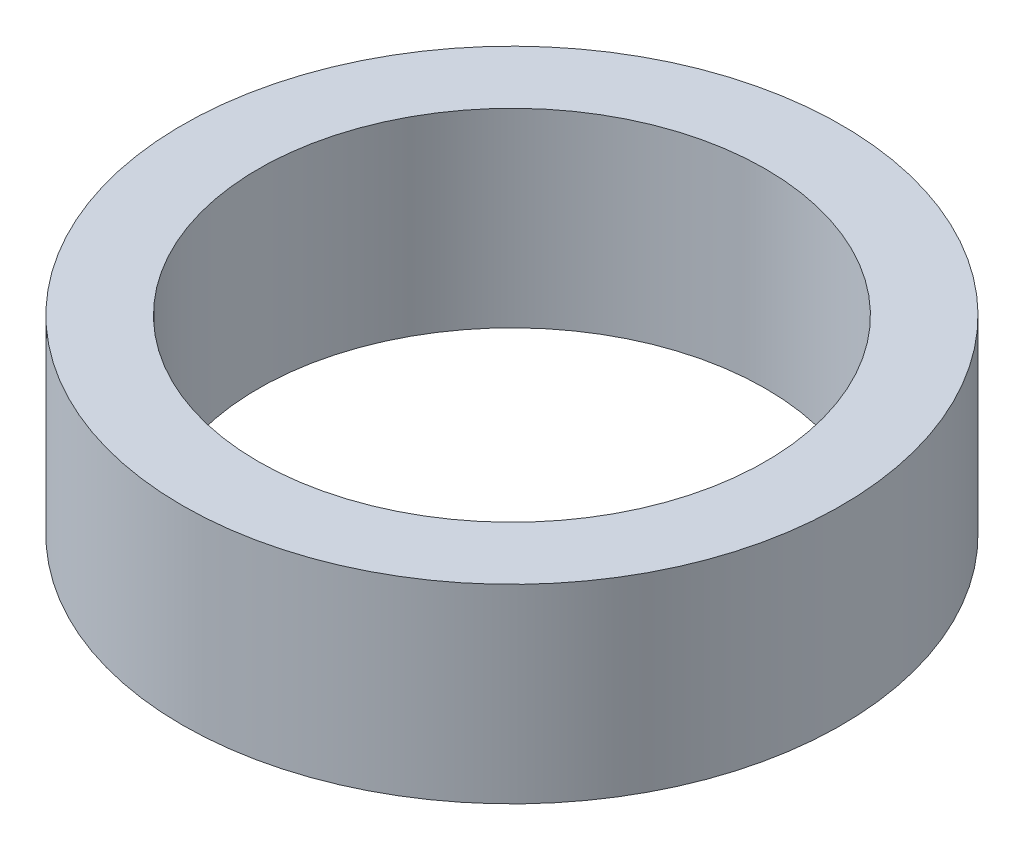
ISO-10303-21;
HEADER;
FILE_DESCRIPTION(('STEP AP214'),'2;1');
FILE_NAME('part.step','',(''),(''),'','','');
FILE_SCHEMA(('AUTOMOTIVE_DESIGN { 1 0 10303 214 1 1 1 1 }'));
ENDSEC;
DATA;
#1=APPLICATION_CONTEXT('core data for automotive mechanical design processes');
#2=APPLICATION_PROTOCOL_DEFINITION('international standard','automotive_design',2000,#1);
#3=PRODUCT_CONTEXT('',#1,'mechanical');
#4=PRODUCT('Part','Part','',(#3));
#5=PRODUCT_RELATED_PRODUCT_CATEGORY('part','',(#4));
#6=PRODUCT_DEFINITION_FORMATION('','',#4);
#7=PRODUCT_DEFINITION_CONTEXT('part definition',#1,'design');
#8=PRODUCT_DEFINITION('design','',#6,#7);
#9=PRODUCT_DEFINITION_SHAPE('','',#8);
#10=(LENGTH_UNIT() NAMED_UNIT(*) SI_UNIT(.MILLI.,.METRE.));
#11=(NAMED_UNIT(*) PLANE_ANGLE_UNIT() SI_UNIT($,.RADIAN.));
#12=(NAMED_UNIT(*) SI_UNIT($,.STERADIAN.) SOLID_ANGLE_UNIT());
#13=UNCERTAINTY_MEASURE_WITH_UNIT(LENGTH_MEASURE(1.E-05),#10,'distance_accuracy_value','');
#14=(GEOMETRIC_REPRESENTATION_CONTEXT(3) GLOBAL_UNCERTAINTY_ASSIGNED_CONTEXT((#13)) GLOBAL_UNIT_ASSIGNED_CONTEXT((#10,
#11,#12)) REPRESENTATION_CONTEXT('',''));
#15=CARTESIAN_POINT('',(0.,0.,0.));
#16=DIRECTION('',(0.,0.,1.));
#17=DIRECTION('',(1.,0.,0.));
#18=AXIS2_PLACEMENT_3D('',#15,#16,#17);
#19=CARTESIAN_POINT('',(0.,1.5,0.));
#20=DIRECTION('',(0.,1.,0.));
#21=DIRECTION('',(0.,0.,1.));
#22=AXIS2_PLACEMENT_3D('',#19,#20,#21);
#23=PLANE('',#22);
#24=CARTESIAN_POINT('',(0.,1.5,0.));
#25=DIRECTION('',(0.,1.,0.));
#26=DIRECTION('',(0.,0.,1.));
#27=AXIS2_PLACEMENT_3D('',#24,#25,#26);
#28=CIRCLE('',#27,2.6);
#29=CARTESIAN_POINT('',(0.,1.5,2.6));
#30=VERTEX_POINT('',#29);
#31=EDGE_CURVE('E10',#30,#30,#28,.T.);
#32=ORIENTED_EDGE('',*,*,#31,.T.);
#33=EDGE_LOOP('',(#32));
#34=FACE_BOUND('',#33,.T.);
#35=CARTESIAN_POINT('',(0.,1.5,0.));
#36=DIRECTION('',(0.,1.,0.));
#37=DIRECTION('',(0.,0.,1.));
#38=AXIS2_PLACEMENT_3D('',#35,#36,#37);
#39=CIRCLE('',#38,2.);
#40=CARTESIAN_POINT('',(0.,1.5,2.));
#41=VERTEX_POINT('',#40);
#42=EDGE_CURVE('E50',#41,#41,#39,.T.);
#43=ORIENTED_EDGE('',*,*,#42,.F.);
#44=EDGE_LOOP('',(#43));
#45=FACE_BOUND('',#44,.T.);
#46=ADVANCED_FACE('F37',(#34,#45),#23,.T.);
#47=CARTESIAN_POINT('',(0.,0.,0.));
#48=DIRECTION('',(0.,1.,0.));
#49=DIRECTION('',(0.,0.,1.));
#50=AXIS2_PLACEMENT_3D('',#47,#48,#49);
#51=PLANE('',#50);
#52=CARTESIAN_POINT('',(0.,0.,0.));
#53=DIRECTION('',(0.,1.,0.));
#54=DIRECTION('',(0.,0.,1.));
#55=AXIS2_PLACEMENT_3D('',#52,#53,#54);
#56=CIRCLE('',#55,2.6);
#57=CARTESIAN_POINT('',(0.,0.,2.6));
#58=VERTEX_POINT('',#57);
#59=EDGE_CURVE('E41',#58,#58,#56,.T.);
#60=ORIENTED_EDGE('',*,*,#59,.F.);
#61=EDGE_LOOP('',(#60));
#62=FACE_BOUND('',#61,.T.);
#63=CARTESIAN_POINT('',(0.,0.,0.));
#64=DIRECTION('',(0.,1.,0.));
#65=DIRECTION('',(0.,0.,1.));
#66=AXIS2_PLACEMENT_3D('',#63,#64,#65);
#67=CIRCLE('',#66,2.);
#68=CARTESIAN_POINT('',(0.,0.,2.));
#69=VERTEX_POINT('',#68);
#70=EDGE_CURVE('E52',#69,#69,#67,.T.);
#71=ORIENTED_EDGE('',*,*,#70,.T.);
#72=EDGE_LOOP('',(#71));
#73=FACE_BOUND('',#72,.T.);
#74=ADVANCED_FACE('F64',(#62,#73),#51,.F.);
#75=CARTESIAN_POINT('',(0.,1.5,0.));
#76=DIRECTION('',(0.,-1.,0.));
#77=DIRECTION('',(0.,0.,-1.));
#78=AXIS2_PLACEMENT_3D('',#75,#76,#77);
#79=CYLINDRICAL_SURFACE('',#78,2.6);
#80=ORIENTED_EDGE('',*,*,#31,.F.);
#81=EDGE_LOOP('',(#80));
#82=FACE_BOUND('',#81,.T.);
#83=ORIENTED_EDGE('',*,*,#59,.T.);
#84=EDGE_LOOP('',(#83));
#85=FACE_BOUND('',#84,.T.);
#86=ADVANCED_FACE('F39',(#82,#85),#79,.T.);
#87=CARTESIAN_POINT('',(0.,1.5,0.));
#88=DIRECTION('',(0.,-1.,0.));
#89=DIRECTION('',(0.,0.,-1.));
#90=AXIS2_PLACEMENT_3D('',#87,#88,#89);
#91=CYLINDRICAL_SURFACE('',#90,2.);
#92=ORIENTED_EDGE('',*,*,#42,.T.);
#93=EDGE_LOOP('',(#92));
#94=FACE_BOUND('',#93,.T.);
#95=ORIENTED_EDGE('',*,*,#70,.F.);
#96=EDGE_LOOP('',(#95));
#97=FACE_BOUND('',#96,.T.);
#98=ADVANCED_FACE('F60',(#94,#97),#91,.F.);
#99=CLOSED_SHELL('',(#46,#74,#86,#98));
#100=MANIFOLD_SOLID_BREP('B2',#99);
#101=ADVANCED_BREP_SHAPE_REPRESENTATION('',(#18,#100),#14);
#102=SHAPE_DEFINITION_REPRESENTATION(#9,#101);
ENDSEC;
END-ISO-10303-21;
